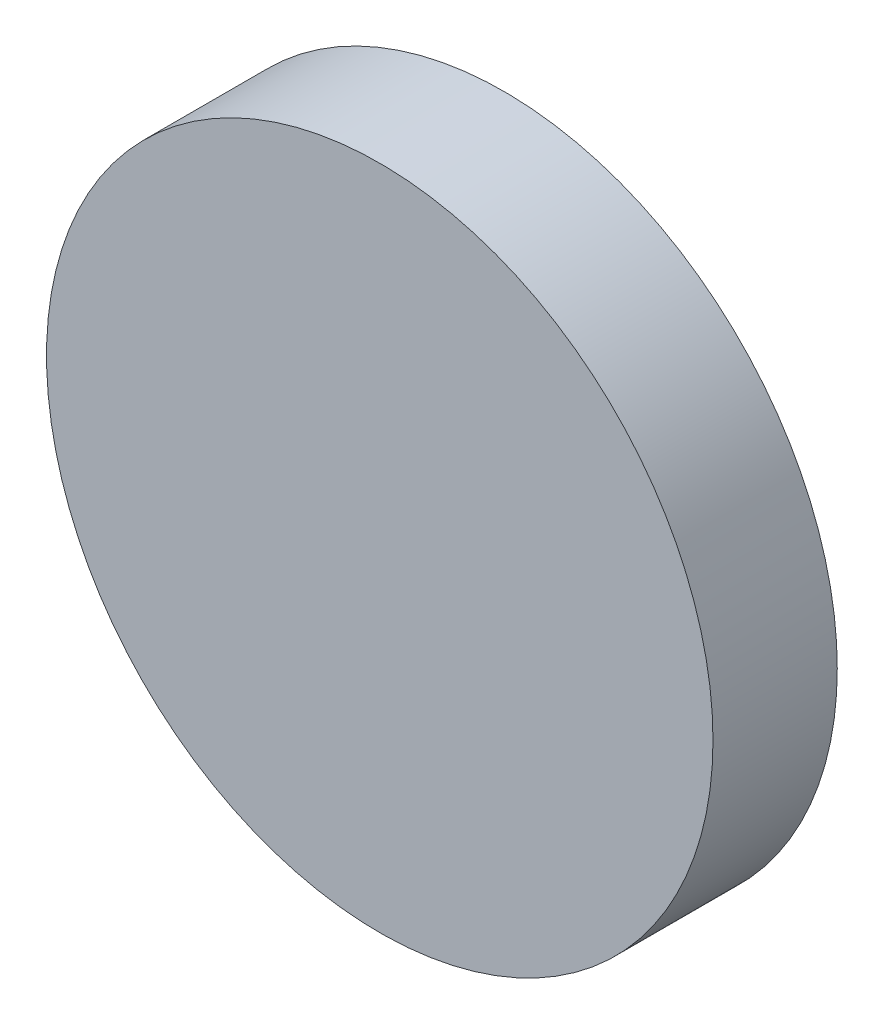
ISO-10303-21;
HEADER;
FILE_DESCRIPTION(('STEP AP214'),'2;1');
FILE_NAME('part.step','',(''),(''),'','','');
FILE_SCHEMA(('AUTOMOTIVE_DESIGN { 1 0 10303 214 1 1 1 1 }'));
ENDSEC;
DATA;
#1=APPLICATION_CONTEXT('core data for automotive mechanical design processes');
#2=APPLICATION_PROTOCOL_DEFINITION('international standard','automotive_design',2000,#1);
#3=PRODUCT_CONTEXT('',#1,'mechanical');
#4=PRODUCT('Part','Part','',(#3));
#5=PRODUCT_RELATED_PRODUCT_CATEGORY('part','',(#4));
#6=PRODUCT_DEFINITION_FORMATION('','',#4);
#7=PRODUCT_DEFINITION_CONTEXT('part definition',#1,'design');
#8=PRODUCT_DEFINITION('design','',#6,#7);
#9=PRODUCT_DEFINITION_SHAPE('','',#8);
#10=(LENGTH_UNIT() NAMED_UNIT(*) SI_UNIT(.MILLI.,.METRE.));
#11=(NAMED_UNIT(*) PLANE_ANGLE_UNIT() SI_UNIT($,.RADIAN.));
#12=(NAMED_UNIT(*) SI_UNIT($,.STERADIAN.) SOLID_ANGLE_UNIT());
#13=UNCERTAINTY_MEASURE_WITH_UNIT(LENGTH_MEASURE(1.E-05),#10,'distance_accuracy_value','');
#14=(GEOMETRIC_REPRESENTATION_CONTEXT(3) GLOBAL_UNCERTAINTY_ASSIGNED_CONTEXT((#13)) GLOBAL_UNIT_ASSIGNED_CONTEXT((#10,
#11,#12)) REPRESENTATION_CONTEXT('',''));
#15=CARTESIAN_POINT('',(0.,0.,0.));
#16=DIRECTION('',(0.,0.,1.));
#17=DIRECTION('',(1.,0.,0.));
#18=AXIS2_PLACEMENT_3D('',#15,#16,#17);
#19=CARTESIAN_POINT('',(0.,0.,14.9));
#20=DIRECTION('',(0.,0.,-1.));
#21=DIRECTION('',(-1.,0.,0.));
#22=AXIS2_PLACEMENT_3D('',#19,#20,#21);
#23=CYLINDRICAL_SURFACE('',#22,39.95);
#24=CARTESIAN_POINT('',(0.,0.,14.9));
#25=DIRECTION('',(0.,0.,1.));
#26=DIRECTION('',(1.,0.,0.));
#27=AXIS2_PLACEMENT_3D('',#24,#25,#26);
#28=CIRCLE('',#27,39.95);
#29=CARTESIAN_POINT('',(39.95,0.,14.9));
#30=VERTEX_POINT('',#29);
#31=EDGE_CURVE('E10',#30,#30,#28,.T.);
#32=ORIENTED_EDGE('',*,*,#31,.F.);
#33=EDGE_LOOP('',(#32));
#34=FACE_BOUND('',#33,.T.);
#35=CARTESIAN_POINT('',(0.,0.,0.));
#36=DIRECTION('',(0.,0.,1.));
#37=DIRECTION('',(1.,0.,0.));
#38=AXIS2_PLACEMENT_3D('',#35,#36,#37);
#39=CIRCLE('',#38,39.95);
#40=CARTESIAN_POINT('',(39.95,0.,0.));
#41=VERTEX_POINT('',#40);
#42=EDGE_CURVE('E44',#41,#41,#39,.T.);
#43=ORIENTED_EDGE('',*,*,#42,.T.);
#44=EDGE_LOOP('',(#43));
#45=FACE_BOUND('',#44,.T.);
#46=ADVANCED_FACE('F41',(#34,#45),#23,.T.);
#47=CARTESIAN_POINT('',(0.,0.,14.9));
#48=DIRECTION('',(0.,0.,1.));
#49=DIRECTION('',(1.,0.,0.));
#50=AXIS2_PLACEMENT_3D('',#47,#48,#49);
#51=PLANE('',#50);
#52=ORIENTED_EDGE('',*,*,#31,.T.);
#53=EDGE_LOOP('',(#52));
#54=FACE_BOUND('',#53,.T.);
#55=ADVANCED_FACE('F58',(#54),#51,.T.);
#56=CARTESIAN_POINT('',(0.,0.,0.));
#57=DIRECTION('',(0.,0.,1.));
#58=DIRECTION('',(1.,0.,0.));
#59=AXIS2_PLACEMENT_3D('',#56,#57,#58);
#60=PLANE('',#59);
#61=ORIENTED_EDGE('',*,*,#42,.F.);
#62=EDGE_LOOP('',(#61));
#63=FACE_BOUND('',#62,.T.);
#64=ADVANCED_FACE('F56',(#63),#60,.F.);
#65=CLOSED_SHELL('',(#46,#55,#64));
#66=MANIFOLD_SOLID_BREP('B2',#65);
#67=ADVANCED_BREP_SHAPE_REPRESENTATION('',(#18,#66),#14);
#68=SHAPE_DEFINITION_REPRESENTATION(#9,#67);
ENDSEC;
END-ISO-10303-21;
